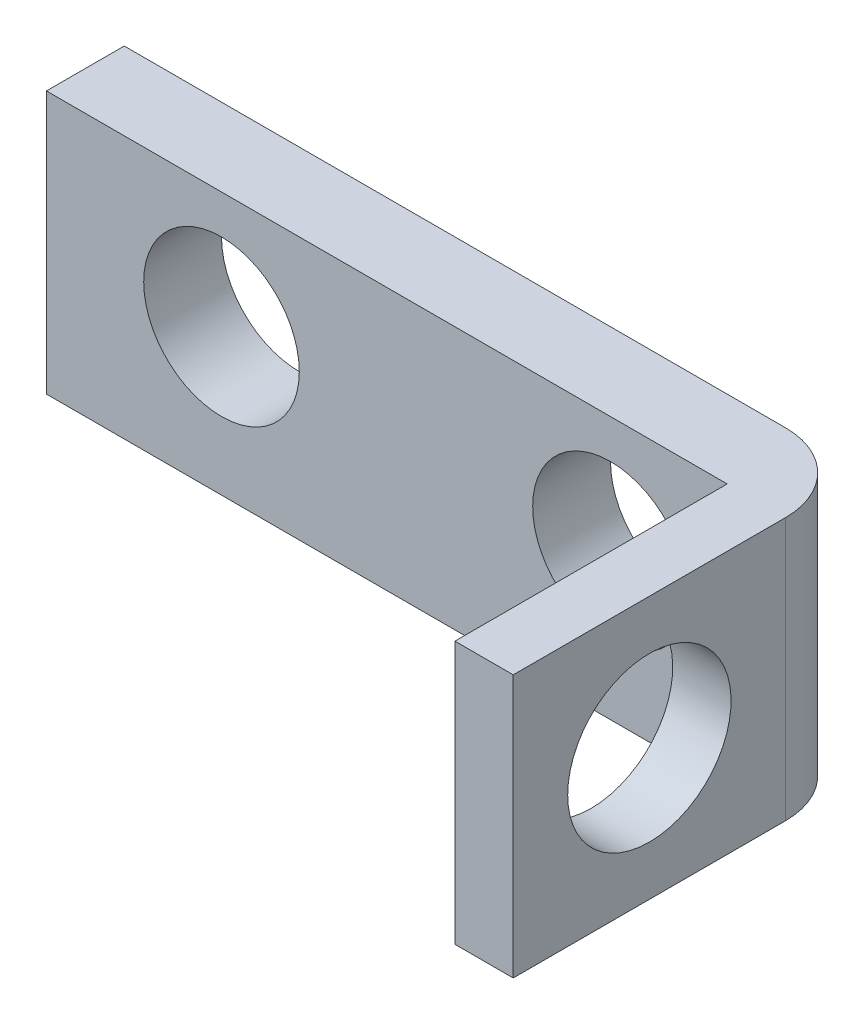
ISO-10303-21;
HEADER;
FILE_DESCRIPTION(('STEP AP214'),'2;1');
FILE_NAME('part.step','',(''),(''),'','','');
FILE_SCHEMA(('AUTOMOTIVE_DESIGN { 1 0 10303 214 1 1 1 1 }'));
ENDSEC;
DATA;
#1=APPLICATION_CONTEXT('core data for automotive mechanical design processes');
#2=APPLICATION_PROTOCOL_DEFINITION('international standard','automotive_design',2000,#1);
#3=PRODUCT_CONTEXT('',#1,'mechanical');
#4=PRODUCT('Part','Part','',(#3));
#5=PRODUCT_RELATED_PRODUCT_CATEGORY('part','',(#4));
#6=PRODUCT_DEFINITION_FORMATION('','',#4);
#7=PRODUCT_DEFINITION_CONTEXT('part definition',#1,'design');
#8=PRODUCT_DEFINITION('design','',#6,#7);
#9=PRODUCT_DEFINITION_SHAPE('','',#8);
#10=(LENGTH_UNIT() NAMED_UNIT(*) SI_UNIT(.MILLI.,.METRE.));
#11=(NAMED_UNIT(*) PLANE_ANGLE_UNIT() SI_UNIT($,.RADIAN.));
#12=(NAMED_UNIT(*) SI_UNIT($,.STERADIAN.) SOLID_ANGLE_UNIT());
#13=UNCERTAINTY_MEASURE_WITH_UNIT(LENGTH_MEASURE(1.E-05),#10,'distance_accuracy_value','');
#14=(GEOMETRIC_REPRESENTATION_CONTEXT(3) GLOBAL_UNCERTAINTY_ASSIGNED_CONTEXT((#13)) GLOBAL_UNIT_ASSIGNED_CONTEXT((#10,
#11,#12)) REPRESENTATION_CONTEXT('',''));
#15=CARTESIAN_POINT('',(0.,0.,0.));
#16=DIRECTION('',(0.,0.,1.));
#17=DIRECTION('',(1.,0.,0.));
#18=AXIS2_PLACEMENT_3D('',#15,#16,#17);
#19=CARTESIAN_POINT('',(0.,0.,2.));
#20=DIRECTION('',(1.,0.,0.));
#21=DIRECTION('',(0.,0.,-1.));
#22=AXIS2_PLACEMENT_3D('',#19,#20,#21);
#23=PLANE('',#22);
#24=DIRECTION('',(0.,-1.,0.));
#25=VECTOR('',#24,1.);
#26=CARTESIAN_POINT('',(0.,0.,0.));
#27=LINE('',#26,#25);
#28=CARTESIAN_POINT('',(0.,0.,0.));
#29=VERTEX_POINT('',#28);
#30=CARTESIAN_POINT('',(0.,-6.75,0.));
#31=VERTEX_POINT('',#30);
#32=EDGE_CURVE('E160',#29,#31,#27,.T.);
#33=ORIENTED_EDGE('',*,*,#32,.T.);
#34=DIRECTION('',(0.,0.,-1.));
#35=VECTOR('',#34,1.);
#36=CARTESIAN_POINT('',(0.,-6.75,2.));
#37=LINE('',#36,#35);
#38=CARTESIAN_POINT('',(0.,-6.75,2.));
#39=VERTEX_POINT('',#38);
#40=EDGE_CURVE('E185',#39,#31,#37,.T.);
#41=ORIENTED_EDGE('',*,*,#40,.F.);
#42=DIRECTION('',(0.,-1.,0.));
#43=VECTOR('',#42,1.);
#44=CARTESIAN_POINT('',(0.,0.,2.));
#45=LINE('',#44,#43);
#46=CARTESIAN_POINT('',(0.,0.,2.));
#47=VERTEX_POINT('',#46);
#48=EDGE_CURVE('E161',#47,#39,#45,.T.);
#49=ORIENTED_EDGE('',*,*,#48,.F.);
#50=DIRECTION('',(0.,0.,-1.));
#51=VECTOR('',#50,1.);
#52=CARTESIAN_POINT('',(0.,0.,2.));
#53=LINE('',#52,#51);
#54=EDGE_CURVE('E107',#47,#29,#53,.T.);
#55=ORIENTED_EDGE('',*,*,#54,.T.);
#56=EDGE_LOOP('',(#33,#41,#49,#55));
#57=FACE_BOUND('',#56,.T.);
#58=ADVANCED_FACE('F39',(#57),#23,.F.);
#59=CARTESIAN_POINT('',(0.,-6.75,2.));
#60=DIRECTION('',(0.,1.,0.));
#61=DIRECTION('',(0.,0.,1.));
#62=AXIS2_PLACEMENT_3D('',#59,#60,#61);
#63=PLANE('',#62);
#64=DIRECTION('',(1.,0.,0.));
#65=VECTOR('',#64,1.);
#66=CARTESIAN_POINT('',(0.,-6.75,0.));
#67=LINE('',#66,#65);
#68=CARTESIAN_POINT('',(17.,-6.75,0.));
#69=VERTEX_POINT('',#68);
#70=EDGE_CURVE('E175',#31,#69,#67,.T.);
#71=ORIENTED_EDGE('',*,*,#70,.T.);
#72=CARTESIAN_POINT('',(17.,-6.75,2.));
#73=DIRECTION('',(0.,1.,0.));
#74=DIRECTION('',(0.,0.,1.));
#75=AXIS2_PLACEMENT_3D('',#72,#73,#74);
#76=CIRCLE('',#75,2.);
#77=CARTESIAN_POINT('',(19.,-6.75,2.));
#78=VERTEX_POINT('',#77);
#79=EDGE_CURVE('E11',#69,#78,#76,.F.);
#80=ORIENTED_EDGE('',*,*,#79,.T.);
#81=DIRECTION('',(0.,0.,-1.));
#82=VECTOR('',#81,1.);
#83=CARTESIAN_POINT('',(19.,-6.75,2.));
#84=LINE('',#83,#82);
#85=CARTESIAN_POINT('',(19.,-6.75,9.));
#86=VERTEX_POINT('',#85);
#87=EDGE_CURVE('E106',#86,#78,#84,.T.);
#88=ORIENTED_EDGE('',*,*,#87,.F.);
#89=DIRECTION('',(1.,0.,0.));
#90=VECTOR('',#89,1.);
#91=CARTESIAN_POINT('',(19.,-6.75,9.));
#92=LINE('',#91,#90);
#93=CARTESIAN_POINT('',(17.5,-6.75,9.));
#94=VERTEX_POINT('',#93);
#95=EDGE_CURVE('E123',#94,#86,#92,.T.);
#96=ORIENTED_EDGE('',*,*,#95,.F.);
#97=DIRECTION('',(0.,0.,-1.));
#98=VECTOR('',#97,1.);
#99=CARTESIAN_POINT('',(17.5,-6.75,9.));
#100=LINE('',#99,#98);
#101=CARTESIAN_POINT('',(17.5,-6.75,2.));
#102=VERTEX_POINT('',#101);
#103=EDGE_CURVE('E137',#94,#102,#100,.T.);
#104=ORIENTED_EDGE('',*,*,#103,.T.);
#105=DIRECTION('',(1.,0.,0.));
#106=VECTOR('',#105,1.);
#107=CARTESIAN_POINT('',(0.,-6.75,2.));
#108=LINE('',#107,#106);
#109=EDGE_CURVE('E165',#39,#102,#108,.T.);
#110=ORIENTED_EDGE('',*,*,#109,.F.);
#111=ORIENTED_EDGE('',*,*,#40,.T.);
#112=EDGE_LOOP('',(#71,#80,#88,#96,#104,#110,#111));
#113=FACE_BOUND('',#112,.T.);
#114=ADVANCED_FACE('F195',(#113),#63,.F.);
#115=CARTESIAN_POINT('',(19.,0.,2.));
#116=DIRECTION('',(-1.,0.,0.));
#117=DIRECTION('',(0.,0.,1.));
#118=AXIS2_PLACEMENT_3D('',#115,#116,#117);
#119=PLANE('',#118);
#120=CARTESIAN_POINT('',(19.,-3.37499999999999,5.5));
#121=DIRECTION('',(-1.,0.,0.));
#122=DIRECTION('',(0.,0.,1.));
#123=AXIS2_PLACEMENT_3D('',#120,#121,#122);
#124=CIRCLE('',#123,2.1);
#125=CARTESIAN_POINT('',(19.,-3.37499999999999,7.6));
#126=VERTEX_POINT('',#125);
#127=EDGE_CURVE('E129',#126,#126,#124,.T.);
#128=ORIENTED_EDGE('',*,*,#127,.T.);
#129=EDGE_LOOP('',(#128));
#130=FACE_BOUND('',#129,.T.);
#131=ORIENTED_EDGE('',*,*,#87,.T.);
#132=DIRECTION('',(0.,1.,0.));
#133=VECTOR('',#132,1.);
#134=CARTESIAN_POINT('',(19.,0.,2.));
#135=LINE('',#134,#133);
#136=CARTESIAN_POINT('',(19.,0.,2.));
#137=VERTEX_POINT('',#136);
#138=EDGE_CURVE('E104',#78,#137,#135,.T.);
#139=ORIENTED_EDGE('',*,*,#138,.T.);
#140=DIRECTION('',(0.,0.,-1.));
#141=VECTOR('',#140,1.);
#142=CARTESIAN_POINT('',(19.,0.,2.));
#143=LINE('',#142,#141);
#144=CARTESIAN_POINT('',(19.,0.,9.));
#145=VERTEX_POINT('',#144);
#146=EDGE_CURVE('E97',#145,#137,#143,.T.);
#147=ORIENTED_EDGE('',*,*,#146,.F.);
#148=DIRECTION('',(0.,1.,0.));
#149=VECTOR('',#148,1.);
#150=CARTESIAN_POINT('',(19.,0.,9.));
#151=LINE('',#150,#149);
#152=EDGE_CURVE('E102',#86,#145,#151,.T.);
#153=ORIENTED_EDGE('',*,*,#152,.F.);
#154=EDGE_LOOP('',(#131,#139,#147,#153));
#155=FACE_BOUND('',#154,.T.);
#156=ADVANCED_FACE('F100',(#130,#155),#119,.F.);
#157=CARTESIAN_POINT('',(0.,0.,2.));
#158=DIRECTION('',(0.,-1.,0.));
#159=DIRECTION('',(0.,0.,-1.));
#160=AXIS2_PLACEMENT_3D('',#157,#158,#159);
#161=PLANE('',#160);
#162=ORIENTED_EDGE('',*,*,#146,.T.);
#163=CARTESIAN_POINT('',(17.,0.,2.));
#164=DIRECTION('',(0.,-1.,0.));
#165=DIRECTION('',(0.,0.,-1.));
#166=AXIS2_PLACEMENT_3D('',#163,#164,#165);
#167=CIRCLE('',#166,2.);
#168=CARTESIAN_POINT('',(17.,0.,0.));
#169=VERTEX_POINT('',#168);
#170=EDGE_CURVE('E62',#137,#169,#167,.F.);
#171=ORIENTED_EDGE('',*,*,#170,.T.);
#172=DIRECTION('',(-1.,0.,0.));
#173=VECTOR('',#172,1.);
#174=CARTESIAN_POINT('',(0.,0.,0.));
#175=LINE('',#174,#173);
#176=EDGE_CURVE('E166',#169,#29,#175,.T.);
#177=ORIENTED_EDGE('',*,*,#176,.T.);
#178=ORIENTED_EDGE('',*,*,#54,.F.);
#179=DIRECTION('',(-1.,0.,0.));
#180=VECTOR('',#179,1.);
#181=CARTESIAN_POINT('',(0.,0.,2.));
#182=LINE('',#181,#180);
#183=CARTESIAN_POINT('',(17.5,0.,2.));
#184=VERTEX_POINT('',#183);
#185=EDGE_CURVE('E169',#184,#47,#182,.T.);
#186=ORIENTED_EDGE('',*,*,#185,.F.);
#187=DIRECTION('',(0.,0.,-1.));
#188=VECTOR('',#187,1.);
#189=CARTESIAN_POINT('',(17.5,0.,9.));
#190=LINE('',#189,#188);
#191=CARTESIAN_POINT('',(17.5,0.,9.));
#192=VERTEX_POINT('',#191);
#193=EDGE_CURVE('E114',#192,#184,#190,.T.);
#194=ORIENTED_EDGE('',*,*,#193,.F.);
#195=DIRECTION('',(-1.,0.,0.));
#196=VECTOR('',#195,1.);
#197=CARTESIAN_POINT('',(19.,0.,9.));
#198=LINE('',#197,#196);
#199=EDGE_CURVE('E110',#145,#192,#198,.T.);
#200=ORIENTED_EDGE('',*,*,#199,.F.);
#201=EDGE_LOOP('',(#162,#171,#177,#178,#186,#194,#200));
#202=FACE_BOUND('',#201,.T.);
#203=ADVANCED_FACE('F111',(#202),#161,.F.);
#204=CARTESIAN_POINT('',(0.,0.,2.));
#205=DIRECTION('',(0.,0.,1.));
#206=DIRECTION('',(1.,0.,0.));
#207=AXIS2_PLACEMENT_3D('',#204,#205,#206);
#208=PLANE('',#207);
#209=DIRECTION('',(0.,-1.,0.));
#210=VECTOR('',#209,1.);
#211=CARTESIAN_POINT('',(17.5,0.,2.));
#212=LINE('',#211,#210);
#213=EDGE_CURVE('E125',#184,#102,#212,.T.);
#214=ORIENTED_EDGE('',*,*,#213,.F.);
#215=ORIENTED_EDGE('',*,*,#185,.T.);
#216=ORIENTED_EDGE('',*,*,#48,.T.);
#217=ORIENTED_EDGE('',*,*,#109,.T.);
#218=EDGE_LOOP('',(#214,#215,#216,#217));
#219=FACE_BOUND('',#218,.T.);
#220=CARTESIAN_POINT('',(14.5,-3.,2.));
#221=DIRECTION('',(0.,0.,1.));
#222=DIRECTION('',(1.,0.,0.));
#223=AXIS2_PLACEMENT_3D('',#220,#221,#222);
#224=CIRCLE('',#223,2.);
#225=CARTESIAN_POINT('',(16.5,-3.,2.));
#226=VERTEX_POINT('',#225);
#227=EDGE_CURVE('E156',#226,#226,#224,.T.);
#228=ORIENTED_EDGE('',*,*,#227,.F.);
#229=EDGE_LOOP('',(#228));
#230=FACE_BOUND('',#229,.T.);
#231=CARTESIAN_POINT('',(4.50000000000001,-3.,2.));
#232=DIRECTION('',(0.,0.,1.));
#233=DIRECTION('',(1.,0.,0.));
#234=AXIS2_PLACEMENT_3D('',#231,#232,#233);
#235=CIRCLE('',#234,2.);
#236=CARTESIAN_POINT('',(6.50000000000001,-3.,2.));
#237=VERTEX_POINT('',#236);
#238=EDGE_CURVE('E149',#237,#237,#235,.T.);
#239=ORIENTED_EDGE('',*,*,#238,.F.);
#240=EDGE_LOOP('',(#239));
#241=FACE_BOUND('',#240,.T.);
#242=ADVANCED_FACE('F207',(#219,#230,#241),#208,.T.);
#243=CARTESIAN_POINT('',(0.,0.,0.));
#244=DIRECTION('',(0.,0.,1.));
#245=DIRECTION('',(1.,0.,0.));
#246=AXIS2_PLACEMENT_3D('',#243,#244,#245);
#247=PLANE('',#246);
#248=CARTESIAN_POINT('',(14.5,-3.,0.));
#249=DIRECTION('',(0.,0.,-1.));
#250=DIRECTION('',(-1.,0.,0.));
#251=AXIS2_PLACEMENT_3D('',#248,#249,#250);
#252=CIRCLE('',#251,2.);
#253=CARTESIAN_POINT('',(12.5,-3.,0.));
#254=VERTEX_POINT('',#253);
#255=EDGE_CURVE('E145',#254,#254,#252,.T.);
#256=ORIENTED_EDGE('',*,*,#255,.F.);
#257=EDGE_LOOP('',(#256));
#258=FACE_BOUND('',#257,.T.);
#259=CARTESIAN_POINT('',(4.50000000000001,-3.,0.));
#260=DIRECTION('',(0.,0.,-1.));
#261=DIRECTION('',(-1.,0.,0.));
#262=AXIS2_PLACEMENT_3D('',#259,#260,#261);
#263=CIRCLE('',#262,2.);
#264=CARTESIAN_POINT('',(2.50000000000001,-3.,0.));
#265=VERTEX_POINT('',#264);
#266=EDGE_CURVE('E144',#265,#265,#263,.T.);
#267=ORIENTED_EDGE('',*,*,#266,.F.);
#268=EDGE_LOOP('',(#267));
#269=FACE_BOUND('',#268,.T.);
#270=ORIENTED_EDGE('',*,*,#176,.F.);
#271=DIRECTION('',(0.,1.,0.));
#272=VECTOR('',#271,1.);
#273=CARTESIAN_POINT('',(17.,0.,0.));
#274=LINE('',#273,#272);
#275=EDGE_CURVE('E48',#169,#69,#274,.F.);
#276=ORIENTED_EDGE('',*,*,#275,.T.);
#277=ORIENTED_EDGE('',*,*,#70,.F.);
#278=ORIENTED_EDGE('',*,*,#32,.F.);
#279=EDGE_LOOP('',(#270,#276,#277,#278));
#280=FACE_BOUND('',#279,.T.);
#281=ADVANCED_FACE('F201',(#258,#269,#280),#247,.F.);
#282=CARTESIAN_POINT('',(4.50000000000001,-3.,10.));
#283=DIRECTION('',(0.,0.,-1.));
#284=DIRECTION('',(-1.,0.,0.));
#285=AXIS2_PLACEMENT_3D('',#282,#283,#284);
#286=CYLINDRICAL_SURFACE('',#285,2.);
#287=ORIENTED_EDGE('',*,*,#238,.T.);
#288=EDGE_LOOP('',(#287));
#289=FACE_BOUND('',#288,.T.);
#290=ORIENTED_EDGE('',*,*,#266,.T.);
#291=EDGE_LOOP('',(#290));
#292=FACE_BOUND('',#291,.T.);
#293=ADVANCED_FACE('F215',(#289,#292),#286,.F.);
#294=CARTESIAN_POINT('',(14.5,-3.,10.));
#295=DIRECTION('',(0.,0.,-1.));
#296=DIRECTION('',(-1.,0.,0.));
#297=AXIS2_PLACEMENT_3D('',#294,#295,#296);
#298=CYLINDRICAL_SURFACE('',#297,2.);
#299=ORIENTED_EDGE('',*,*,#227,.T.);
#300=EDGE_LOOP('',(#299));
#301=FACE_BOUND('',#300,.T.);
#302=ORIENTED_EDGE('',*,*,#255,.T.);
#303=EDGE_LOOP('',(#302));
#304=FACE_BOUND('',#303,.T.);
#305=ADVANCED_FACE('F218',(#301,#304),#298,.F.);
#306=CARTESIAN_POINT('',(17.5,0.,9.));
#307=DIRECTION('',(1.,0.,0.));
#308=DIRECTION('',(0.,1.,0.));
#309=AXIS2_PLACEMENT_3D('',#306,#307,#308);
#310=PLANE('',#309);
#311=CARTESIAN_POINT('',(17.5,-3.375,5.5));
#312=DIRECTION('',(-1.,0.,0.));
#313=DIRECTION('',(0.,-1.,0.));
#314=AXIS2_PLACEMENT_3D('',#311,#312,#313);
#315=CIRCLE('',#314,2.1);
#316=CARTESIAN_POINT('',(17.5,-5.475,5.5));
#317=VERTEX_POINT('',#316);
#318=EDGE_CURVE('E332',#317,#317,#315,.T.);
#319=ORIENTED_EDGE('',*,*,#318,.F.);
#320=EDGE_LOOP('',(#319));
#321=FACE_BOUND('',#320,.T.);
#322=ORIENTED_EDGE('',*,*,#213,.T.);
#323=ORIENTED_EDGE('',*,*,#103,.F.);
#324=DIRECTION('',(0.,-1.,0.));
#325=VECTOR('',#324,1.);
#326=CARTESIAN_POINT('',(17.5,0.,9.));
#327=LINE('',#326,#325);
#328=EDGE_CURVE('E118',#192,#94,#327,.T.);
#329=ORIENTED_EDGE('',*,*,#328,.F.);
#330=ORIENTED_EDGE('',*,*,#193,.T.);
#331=EDGE_LOOP('',(#322,#323,#329,#330));
#332=FACE_BOUND('',#331,.T.);
#333=ADVANCED_FACE('F205',(#321,#332),#310,.F.);
#334=CARTESIAN_POINT('',(0.,0.,9.));
#335=DIRECTION('',(0.,0.,-1.));
#336=DIRECTION('',(-1.,0.,0.));
#337=AXIS2_PLACEMENT_3D('',#334,#335,#336);
#338=PLANE('',#337);
#339=ORIENTED_EDGE('',*,*,#152,.T.);
#340=ORIENTED_EDGE('',*,*,#199,.T.);
#341=ORIENTED_EDGE('',*,*,#328,.T.);
#342=ORIENTED_EDGE('',*,*,#95,.T.);
#343=EDGE_LOOP('',(#339,#340,#341,#342));
#344=FACE_BOUND('',#343,.T.);
#345=ADVANCED_FACE('F121',(#344),#338,.F.);
#346=CARTESIAN_POINT('',(17.,0.,2.));
#347=DIRECTION('',(0.,1.,0.));
#348=DIRECTION('',(0.,0.,1.));
#349=AXIS2_PLACEMENT_3D('',#346,#347,#348);
#350=CYLINDRICAL_SURFACE('',#349,2.);
#351=ORIENTED_EDGE('',*,*,#79,.F.);
#352=ORIENTED_EDGE('',*,*,#275,.F.);
#353=ORIENTED_EDGE('',*,*,#170,.F.);
#354=ORIENTED_EDGE('',*,*,#138,.F.);
#355=EDGE_LOOP('',(#351,#352,#353,#354));
#356=FACE_BOUND('',#355,.T.);
#357=ADVANCED_FACE('F41',(#356),#350,.T.);
#358=CARTESIAN_POINT('',(20.5,-3.37499999999999,5.5));
#359=DIRECTION('',(-1.,0.,0.));
#360=DIRECTION('',(0.,-1.,0.));
#361=AXIS2_PLACEMENT_3D('',#358,#359,#360);
#362=CYLINDRICAL_SURFACE('',#361,2.1);
#363=ORIENTED_EDGE('',*,*,#318,.T.);
#364=EDGE_LOOP('',(#363));
#365=FACE_BOUND('',#364,.T.);
#366=ORIENTED_EDGE('',*,*,#127,.F.);
#367=EDGE_LOOP('',(#366));
#368=FACE_BOUND('',#367,.T.);
#369=ADVANCED_FACE('F302',(#365,#368),#362,.F.);
#370=CLOSED_SHELL('',(#58,#114,#156,#203,#242,#281,#293,#305,#333,#345,#357,#369));
#371=MANIFOLD_SOLID_BREP('B2',#370);
#372=ADVANCED_BREP_SHAPE_REPRESENTATION('',(#18,#371),#14);
#373=SHAPE_DEFINITION_REPRESENTATION(#9,#372);
ENDSEC;
END-ISO-10303-21;
